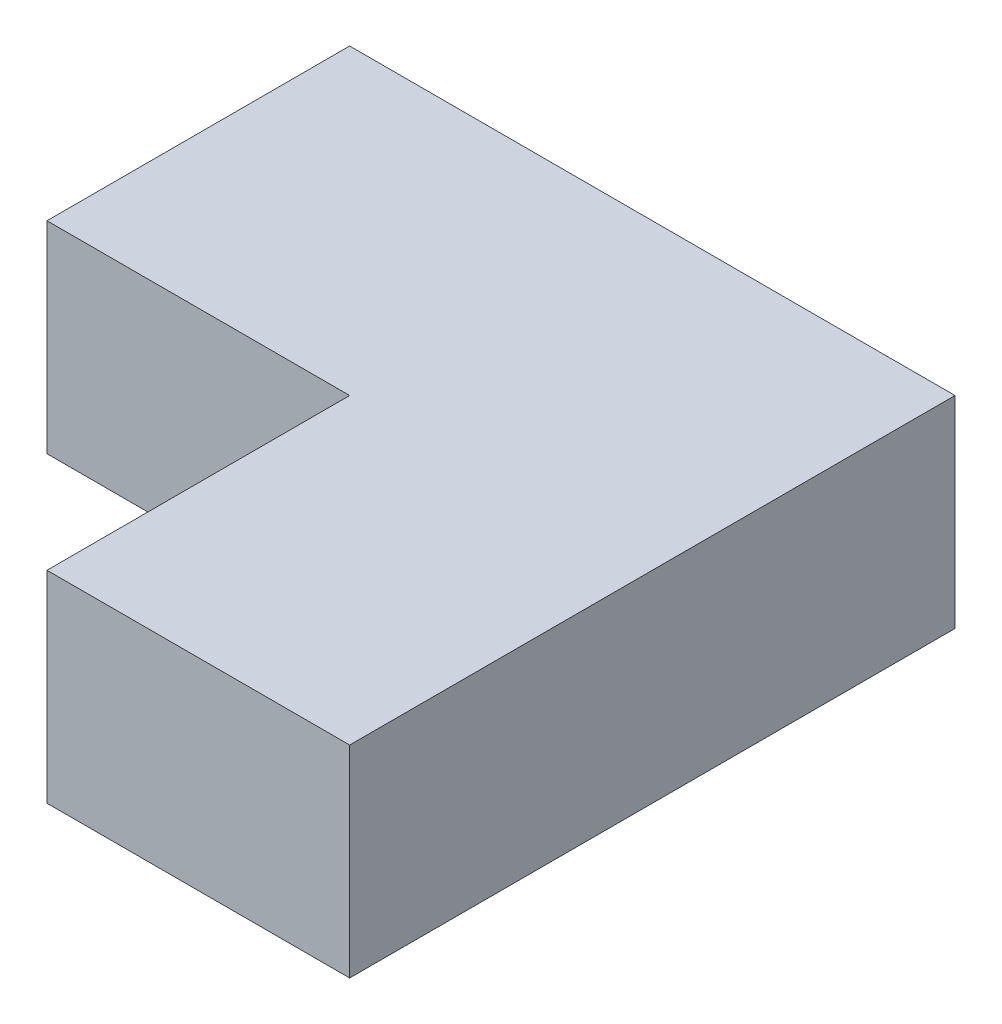
ISO-10303-21;
HEADER;
FILE_DESCRIPTION(('STEP AP214'),'2;1');
FILE_NAME('part.step','',(''),(''),'','','');
FILE_SCHEMA(('AUTOMOTIVE_DESIGN { 1 0 10303 214 1 1 1 1 }'));
ENDSEC;
DATA;
#1=APPLICATION_CONTEXT('core data for automotive mechanical design processes');
#2=APPLICATION_PROTOCOL_DEFINITION('international standard','automotive_design',2000,#1);
#3=PRODUCT_CONTEXT('',#1,'mechanical');
#4=PRODUCT('Part','Part','',(#3));
#5=PRODUCT_RELATED_PRODUCT_CATEGORY('part','',(#4));
#6=PRODUCT_DEFINITION_FORMATION('','',#4);
#7=PRODUCT_DEFINITION_CONTEXT('part definition',#1,'design');
#8=PRODUCT_DEFINITION('design','',#6,#7);
#9=PRODUCT_DEFINITION_SHAPE('','',#8);
#10=(LENGTH_UNIT() NAMED_UNIT(*) SI_UNIT(.MILLI.,.METRE.));
#11=(NAMED_UNIT(*) PLANE_ANGLE_UNIT() SI_UNIT($,.RADIAN.));
#12=(NAMED_UNIT(*) SI_UNIT($,.STERADIAN.) SOLID_ANGLE_UNIT());
#13=UNCERTAINTY_MEASURE_WITH_UNIT(LENGTH_MEASURE(1.E-05),#10,'distance_accuracy_value','');
#14=(GEOMETRIC_REPRESENTATION_CONTEXT(3) GLOBAL_UNCERTAINTY_ASSIGNED_CONTEXT((#13)) GLOBAL_UNIT_ASSIGNED_CONTEXT((#10,
#11,#12)) REPRESENTATION_CONTEXT('',''));
#15=CARTESIAN_POINT('',(0.,0.,0.));
#16=DIRECTION('',(0.,0.,1.));
#17=DIRECTION('',(1.,0.,0.));
#18=AXIS2_PLACEMENT_3D('',#15,#16,#17);
#19=CARTESIAN_POINT('',(0.,0.2,0.));
#20=DIRECTION('',(0.,1.,0.));
#21=DIRECTION('',(1.,0.,0.));
#22=AXIS2_PLACEMENT_3D('',#19,#20,#21);
#23=PLANE('',#22);
#24=DIRECTION('',(1.,0.,0.));
#25=VECTOR('',#24,1.);
#26=CARTESIAN_POINT('',(-1.5,0.2,1.35));
#27=LINE('',#26,#25);
#28=CARTESIAN_POINT('',(-1.5,0.2,1.35));
#29=VERTEX_POINT('',#28);
#30=CARTESIAN_POINT('',(-1.35,0.2,1.35));
#31=VERTEX_POINT('',#30);
#32=EDGE_CURVE('E11',#29,#31,#27,.T.);
#33=ORIENTED_EDGE('',*,*,#32,.T.);
#34=DIRECTION('',(0.,0.,1.));
#35=VECTOR('',#34,1.);
#36=CARTESIAN_POINT('',(-1.35,0.2,1.35));
#37=LINE('',#36,#35);
#38=CARTESIAN_POINT('',(-1.35,0.2,1.5));
#39=VERTEX_POINT('',#38);
#40=EDGE_CURVE('E24',#31,#39,#37,.T.);
#41=ORIENTED_EDGE('',*,*,#40,.T.);
#42=DIRECTION('',(1.,0.,0.));
#43=VECTOR('',#42,1.);
#44=CARTESIAN_POINT('',(-1.35,0.2,1.5));
#45=LINE('',#44,#43);
#46=CARTESIAN_POINT('',(-1.2,0.2,1.5));
#47=VERTEX_POINT('',#46);
#48=EDGE_CURVE('E116',#39,#47,#45,.T.);
#49=ORIENTED_EDGE('',*,*,#48,.T.);
#50=DIRECTION('',(0.,0.,-1.));
#51=VECTOR('',#50,1.);
#52=CARTESIAN_POINT('',(-1.2,0.2,1.5));
#53=LINE('',#52,#51);
#54=CARTESIAN_POINT('',(-1.2,0.2,1.2));
#55=VERTEX_POINT('',#54);
#56=EDGE_CURVE('E114',#47,#55,#53,.T.);
#57=ORIENTED_EDGE('',*,*,#56,.T.);
#58=DIRECTION('',(-1.,0.,0.));
#59=VECTOR('',#58,1.);
#60=CARTESIAN_POINT('',(-1.2,0.2,1.2));
#61=LINE('',#60,#59);
#62=CARTESIAN_POINT('',(-1.5,0.2,1.2));
#63=VERTEX_POINT('',#62);
#64=EDGE_CURVE('E74',#55,#63,#61,.T.);
#65=ORIENTED_EDGE('',*,*,#64,.T.);
#66=DIRECTION('',(0.,0.,1.));
#67=VECTOR('',#66,1.);
#68=CARTESIAN_POINT('',(-1.5,0.2,1.2));
#69=LINE('',#68,#67);
#70=EDGE_CURVE('E36',#63,#29,#69,.T.);
#71=ORIENTED_EDGE('',*,*,#70,.T.);
#72=EDGE_LOOP('',(#33,#41,#49,#57,#65,#71));
#73=FACE_BOUND('',#72,.T.);
#74=ADVANCED_FACE('F17',(#73),#23,.T.);
#75=CARTESIAN_POINT('',(-1.5,0.2,1.2));
#76=DIRECTION('',(-1.,0.,0.));
#77=DIRECTION('',(0.,0.,1.));
#78=AXIS2_PLACEMENT_3D('',#75,#76,#77);
#79=PLANE('',#78);
#80=DIRECTION('',(0.,-1.,0.));
#81=VECTOR('',#80,1.);
#82=CARTESIAN_POINT('',(-1.5,0.2,1.2));
#83=LINE('',#82,#81);
#84=CARTESIAN_POINT('',(-1.5,0.1,1.2));
#85=VERTEX_POINT('',#84);
#86=EDGE_CURVE('E110',#63,#85,#83,.T.);
#87=ORIENTED_EDGE('',*,*,#86,.T.);
#88=DIRECTION('',(0.,0.,1.));
#89=VECTOR('',#88,1.);
#90=CARTESIAN_POINT('',(-1.5,0.1,1.2));
#91=LINE('',#90,#89);
#92=CARTESIAN_POINT('',(-1.5,0.1,1.35));
#93=VERTEX_POINT('',#92);
#94=EDGE_CURVE('E90',#85,#93,#91,.T.);
#95=ORIENTED_EDGE('',*,*,#94,.T.);
#96=DIRECTION('',(0.,-1.,0.));
#97=VECTOR('',#96,1.);
#98=CARTESIAN_POINT('',(-1.5,0.2,1.35));
#99=LINE('',#98,#97);
#100=EDGE_CURVE('E107',#29,#93,#99,.T.);
#101=ORIENTED_EDGE('',*,*,#100,.F.);
#102=ORIENTED_EDGE('',*,*,#70,.F.);
#103=EDGE_LOOP('',(#87,#95,#101,#102));
#104=FACE_BOUND('',#103,.T.);
#105=ADVANCED_FACE('F127',(#104),#79,.T.);
#106=CARTESIAN_POINT('',(-1.5,0.2,1.35));
#107=DIRECTION('',(0.,0.,1.));
#108=DIRECTION('',(1.,0.,0.));
#109=AXIS2_PLACEMENT_3D('',#106,#107,#108);
#110=PLANE('',#109);
#111=ORIENTED_EDGE('',*,*,#100,.T.);
#112=DIRECTION('',(1.,0.,0.));
#113=VECTOR('',#112,1.);
#114=CARTESIAN_POINT('',(-1.5,0.1,1.35));
#115=LINE('',#114,#113);
#116=CARTESIAN_POINT('',(-1.35,0.1,1.35));
#117=VERTEX_POINT('',#116);
#118=EDGE_CURVE('E104',#93,#117,#115,.T.);
#119=ORIENTED_EDGE('',*,*,#118,.T.);
#120=DIRECTION('',(0.,-1.,0.));
#121=VECTOR('',#120,1.);
#122=CARTESIAN_POINT('',(-1.35,0.2,1.35));
#123=LINE('',#122,#121);
#124=EDGE_CURVE('E102',#31,#117,#123,.T.);
#125=ORIENTED_EDGE('',*,*,#124,.F.);
#126=ORIENTED_EDGE('',*,*,#32,.F.);
#127=EDGE_LOOP('',(#111,#119,#125,#126));
#128=FACE_BOUND('',#127,.T.);
#129=ADVANCED_FACE('F124',(#128),#110,.T.);
#130=CARTESIAN_POINT('',(-1.35,0.2,1.35));
#131=DIRECTION('',(-1.,0.,0.));
#132=DIRECTION('',(0.,0.,1.));
#133=AXIS2_PLACEMENT_3D('',#130,#131,#132);
#134=PLANE('',#133);
#135=ORIENTED_EDGE('',*,*,#124,.T.);
#136=DIRECTION('',(0.,0.,1.));
#137=VECTOR('',#136,1.);
#138=CARTESIAN_POINT('',(-1.35,0.1,1.35));
#139=LINE('',#138,#137);
#140=CARTESIAN_POINT('',(-1.35,0.1,1.5));
#141=VERTEX_POINT('',#140);
#142=EDGE_CURVE('E99',#117,#141,#139,.T.);
#143=ORIENTED_EDGE('',*,*,#142,.T.);
#144=DIRECTION('',(0.,-1.,0.));
#145=VECTOR('',#144,1.);
#146=CARTESIAN_POINT('',(-1.35,0.2,1.5));
#147=LINE('',#146,#145);
#148=EDGE_CURVE('E97',#39,#141,#147,.T.);
#149=ORIENTED_EDGE('',*,*,#148,.F.);
#150=ORIENTED_EDGE('',*,*,#40,.F.);
#151=EDGE_LOOP('',(#135,#143,#149,#150));
#152=FACE_BOUND('',#151,.T.);
#153=ADVANCED_FACE('F119',(#152),#134,.T.);
#154=CARTESIAN_POINT('',(-1.35,0.2,1.5));
#155=DIRECTION('',(0.,0.,1.));
#156=DIRECTION('',(1.,0.,0.));
#157=AXIS2_PLACEMENT_3D('',#154,#155,#156);
#158=PLANE('',#157);
#159=ORIENTED_EDGE('',*,*,#148,.T.);
#160=DIRECTION('',(1.,0.,0.));
#161=VECTOR('',#160,1.);
#162=CARTESIAN_POINT('',(-1.35,0.1,1.5));
#163=LINE('',#162,#161);
#164=CARTESIAN_POINT('',(-1.2,0.1,1.5));
#165=VERTEX_POINT('',#164);
#166=EDGE_CURVE('E95',#141,#165,#163,.T.);
#167=ORIENTED_EDGE('',*,*,#166,.T.);
#168=DIRECTION('',(0.,-1.,0.));
#169=VECTOR('',#168,1.);
#170=CARTESIAN_POINT('',(-1.2,0.2,1.5));
#171=LINE('',#170,#169);
#172=EDGE_CURVE('E82',#47,#165,#171,.T.);
#173=ORIENTED_EDGE('',*,*,#172,.F.);
#174=ORIENTED_EDGE('',*,*,#48,.F.);
#175=EDGE_LOOP('',(#159,#167,#173,#174));
#176=FACE_BOUND('',#175,.T.);
#177=ADVANCED_FACE('F122',(#176),#158,.T.);
#178=CARTESIAN_POINT('',(-1.2,0.2,1.5));
#179=DIRECTION('',(1.,0.,0.));
#180=DIRECTION('',(0.,0.,-1.));
#181=AXIS2_PLACEMENT_3D('',#178,#179,#180);
#182=PLANE('',#181);
#183=ORIENTED_EDGE('',*,*,#172,.T.);
#184=DIRECTION('',(0.,0.,-1.));
#185=VECTOR('',#184,1.);
#186=CARTESIAN_POINT('',(-1.2,0.1,1.5));
#187=LINE('',#186,#185);
#188=CARTESIAN_POINT('',(-1.2,0.1,1.2));
#189=VERTEX_POINT('',#188);
#190=EDGE_CURVE('E77',#165,#189,#187,.T.);
#191=ORIENTED_EDGE('',*,*,#190,.T.);
#192=DIRECTION('',(0.,-1.,0.));
#193=VECTOR('',#192,1.);
#194=CARTESIAN_POINT('',(-1.2,0.2,1.2));
#195=LINE('',#194,#193);
#196=EDGE_CURVE('E68',#55,#189,#195,.T.);
#197=ORIENTED_EDGE('',*,*,#196,.F.);
#198=ORIENTED_EDGE('',*,*,#56,.F.);
#199=EDGE_LOOP('',(#183,#191,#197,#198));
#200=FACE_BOUND('',#199,.T.);
#201=ADVANCED_FACE('F80',(#200),#182,.T.);
#202=CARTESIAN_POINT('',(-1.2,0.2,1.2));
#203=DIRECTION('',(0.,0.,-1.));
#204=DIRECTION('',(-1.,0.,0.));
#205=AXIS2_PLACEMENT_3D('',#202,#203,#204);
#206=PLANE('',#205);
#207=ORIENTED_EDGE('',*,*,#196,.T.);
#208=DIRECTION('',(-1.,0.,0.));
#209=VECTOR('',#208,1.);
#210=CARTESIAN_POINT('',(-1.2,0.1,1.2));
#211=LINE('',#210,#209);
#212=EDGE_CURVE('E73',#189,#85,#211,.T.);
#213=ORIENTED_EDGE('',*,*,#212,.T.);
#214=ORIENTED_EDGE('',*,*,#86,.F.);
#215=ORIENTED_EDGE('',*,*,#64,.F.);
#216=EDGE_LOOP('',(#207,#213,#214,#215));
#217=FACE_BOUND('',#216,.T.);
#218=ADVANCED_FACE('F70',(#217),#206,.T.);
#219=CARTESIAN_POINT('',(0.,0.1,0.));
#220=DIRECTION('',(0.,1.,0.));
#221=DIRECTION('',(1.,0.,0.));
#222=AXIS2_PLACEMENT_3D('',#219,#220,#221);
#223=PLANE('',#222);
#224=ORIENTED_EDGE('',*,*,#212,.F.);
#225=ORIENTED_EDGE('',*,*,#190,.F.);
#226=ORIENTED_EDGE('',*,*,#166,.F.);
#227=ORIENTED_EDGE('',*,*,#142,.F.);
#228=ORIENTED_EDGE('',*,*,#118,.F.);
#229=ORIENTED_EDGE('',*,*,#94,.F.);
#230=EDGE_LOOP('',(#224,#225,#226,#227,#228,#229));
#231=FACE_BOUND('',#230,.T.);
#232=ADVANCED_FACE('F87',(#231),#223,.F.);
#233=CLOSED_SHELL('',(#74,#105,#129,#153,#177,#201,#218,#232));
#234=MANIFOLD_SOLID_BREP('B1',#233);
#235=ADVANCED_BREP_SHAPE_REPRESENTATION('',(#18,#234),#14);
#236=SHAPE_DEFINITION_REPRESENTATION(#9,#235);
ENDSEC;
END-ISO-10303-21;
